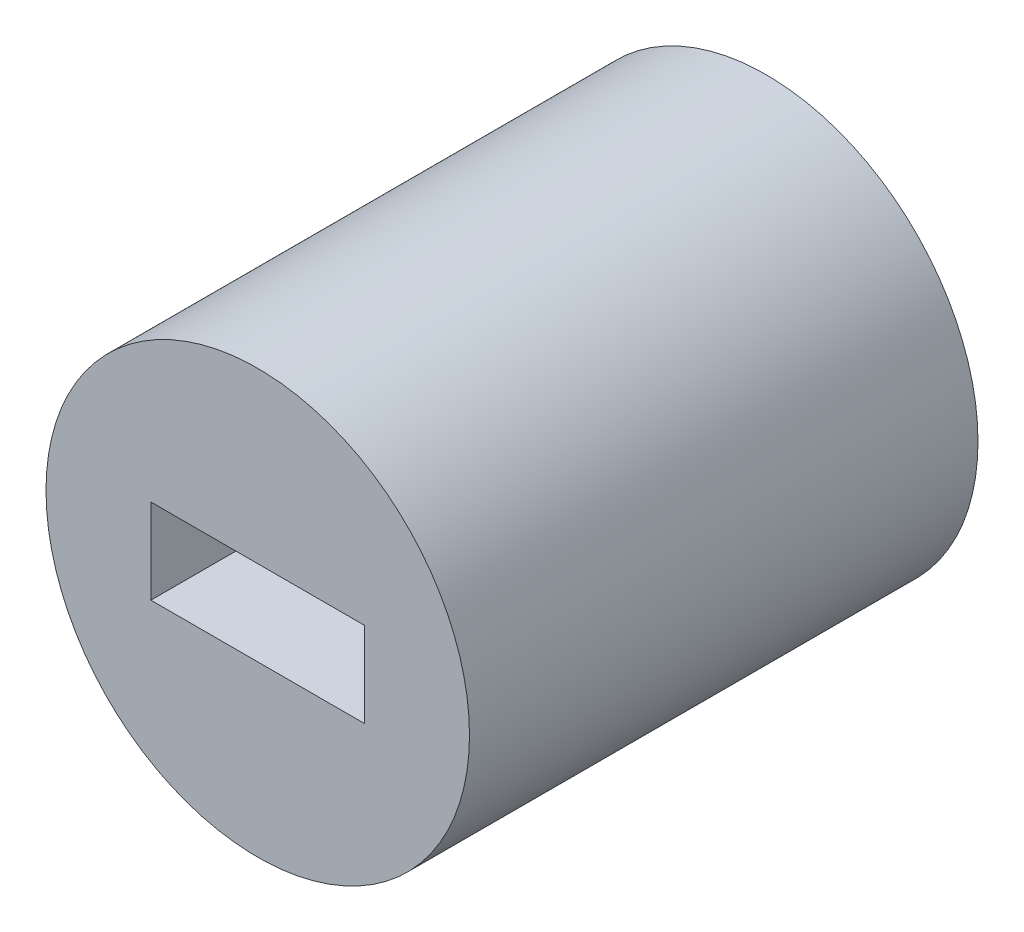
ISO-10303-21;
HEADER;
FILE_DESCRIPTION(('STEP AP214'),'2;1');
FILE_NAME('part.step','',(''),(''),'','','');
FILE_SCHEMA(('AUTOMOTIVE_DESIGN { 1 0 10303 214 1 1 1 1 }'));
ENDSEC;
DATA;
#1=APPLICATION_CONTEXT('core data for automotive mechanical design processes');
#2=APPLICATION_PROTOCOL_DEFINITION('international standard','automotive_design',2000,#1);
#3=PRODUCT_CONTEXT('',#1,'mechanical');
#4=PRODUCT('Part','Part','',(#3));
#5=PRODUCT_RELATED_PRODUCT_CATEGORY('part','',(#4));
#6=PRODUCT_DEFINITION_FORMATION('','',#4);
#7=PRODUCT_DEFINITION_CONTEXT('part definition',#1,'design');
#8=PRODUCT_DEFINITION('design','',#6,#7);
#9=PRODUCT_DEFINITION_SHAPE('','',#8);
#10=(LENGTH_UNIT() NAMED_UNIT(*) SI_UNIT(.MILLI.,.METRE.));
#11=(NAMED_UNIT(*) PLANE_ANGLE_UNIT() SI_UNIT($,.RADIAN.));
#12=(NAMED_UNIT(*) SI_UNIT($,.STERADIAN.) SOLID_ANGLE_UNIT());
#13=UNCERTAINTY_MEASURE_WITH_UNIT(LENGTH_MEASURE(1.E-05),#10,'distance_accuracy_value','');
#14=(GEOMETRIC_REPRESENTATION_CONTEXT(3) GLOBAL_UNCERTAINTY_ASSIGNED_CONTEXT((#13)) GLOBAL_UNIT_ASSIGNED_CONTEXT((#10,
#11,#12)) REPRESENTATION_CONTEXT('',''));
#15=CARTESIAN_POINT('',(0.,0.,0.));
#16=DIRECTION('',(0.,0.,1.));
#17=DIRECTION('',(1.,0.,0.));
#18=AXIS2_PLACEMENT_3D('',#15,#16,#17);
#19=CARTESIAN_POINT('',(-0.64100581951225,0.,3.05));
#20=DIRECTION('',(1.,0.,0.));
#21=DIRECTION('',(0.,1.,0.));
#22=AXIS2_PLACEMENT_3D('',#19,#20,#21);
#23=PLANE('',#22);
#24=DIRECTION('',(0.,1.,0.));
#25=VECTOR('',#24,1.);
#26=CARTESIAN_POINT('',(-0.64100581951225,0.,1.55));
#27=LINE('',#26,#25);
#28=CARTESIAN_POINT('',(-0.64100581951225,0.255,1.55));
#29=VERTEX_POINT('',#28);
#30=CARTESIAN_POINT('',(-0.64100581951225,-0.255,1.55));
#31=VERTEX_POINT('',#30);
#32=EDGE_CURVE('E114',#29,#31,#27,.F.);
#33=ORIENTED_EDGE('',*,*,#32,.F.);
#34=DIRECTION('',(0.,0.,1.));
#35=VECTOR('',#34,1.);
#36=CARTESIAN_POINT('',(-0.64100581951225,0.255,3.05));
#37=LINE('',#36,#35);
#38=CARTESIAN_POINT('',(-0.64100581951225,0.255,3.05));
#39=VERTEX_POINT('',#38);
#40=EDGE_CURVE('E122',#39,#29,#37,.F.);
#41=ORIENTED_EDGE('',*,*,#40,.F.);
#42=DIRECTION('',(0.,1.,0.));
#43=VECTOR('',#42,1.);
#44=CARTESIAN_POINT('',(-0.64100581951225,0.,3.05));
#45=LINE('',#44,#43);
#46=CARTESIAN_POINT('',(-0.64100581951225,-0.255,3.05));
#47=VERTEX_POINT('',#46);
#48=EDGE_CURVE('E32',#39,#47,#45,.F.);
#49=ORIENTED_EDGE('',*,*,#48,.T.);
#50=DIRECTION('',(0.,0.,1.));
#51=VECTOR('',#50,1.);
#52=CARTESIAN_POINT('',(-0.64100581951225,-0.255,3.05));
#53=LINE('',#52,#51);
#54=EDGE_CURVE('E119',#31,#47,#53,.T.);
#55=ORIENTED_EDGE('',*,*,#54,.F.);
#56=EDGE_LOOP('',(#33,#41,#49,#55));
#57=FACE_BOUND('',#56,.T.);
#58=ADVANCED_FACE('F16',(#57),#23,.T.);
#59=CARTESIAN_POINT('',(0.,0.,1.55));
#60=DIRECTION('',(0.,0.,1.));
#61=DIRECTION('',(1.,0.,0.));
#62=AXIS2_PLACEMENT_3D('',#59,#60,#61);
#63=PLANE('',#62);
#64=DIRECTION('',(-1.,0.,0.));
#65=VECTOR('',#64,1.);
#66=CARTESIAN_POINT('',(0.528723609904574,-0.255,1.55));
#67=LINE('',#66,#65);
#68=CARTESIAN_POINT('',(-0.416441400296898,-0.255,1.55));
#69=VERTEX_POINT('',#68);
#70=EDGE_CURVE('E127',#69,#31,#67,.T.);
#71=ORIENTED_EDGE('',*,*,#70,.F.);
#72=DIRECTION('',(0.,-1.,0.));
#73=VECTOR('',#72,1.);
#74=CARTESIAN_POINT('',(-0.416441400296898,0.,1.55));
#75=LINE('',#74,#73);
#76=CARTESIAN_POINT('',(-0.416441400296898,0.255,1.55));
#77=VERTEX_POINT('',#76);
#78=EDGE_CURVE('E112',#69,#77,#75,.F.);
#79=ORIENTED_EDGE('',*,*,#78,.T.);
#80=DIRECTION('',(1.,0.,0.));
#81=VECTOR('',#80,1.);
#82=CARTESIAN_POINT('',(-0.528723609904574,0.255,1.55));
#83=LINE('',#82,#81);
#84=EDGE_CURVE('E148',#29,#77,#83,.T.);
#85=ORIENTED_EDGE('',*,*,#84,.F.);
#86=ORIENTED_EDGE('',*,*,#32,.T.);
#87=EDGE_LOOP('',(#71,#79,#85,#86));
#88=FACE_BOUND('',#87,.T.);
#89=ADVANCED_FACE('F159',(#88),#63,.T.);
#90=CARTESIAN_POINT('',(-0.416441400296898,0.,3.05));
#91=DIRECTION('',(-1.,0.,0.));
#92=DIRECTION('',(0.,-1.,0.));
#93=AXIS2_PLACEMENT_3D('',#90,#91,#92);
#94=PLANE('',#93);
#95=DIRECTION('',(0.,0.,1.));
#96=VECTOR('',#95,1.);
#97=CARTESIAN_POINT('',(-0.416441400296898,0.255,3.05));
#98=LINE('',#97,#96);
#99=CARTESIAN_POINT('',(-0.416441400296898,0.255,0.));
#100=VERTEX_POINT('',#99);
#101=EDGE_CURVE('E145',#77,#100,#98,.F.);
#102=ORIENTED_EDGE('',*,*,#101,.F.);
#103=ORIENTED_EDGE('',*,*,#78,.F.);
#104=DIRECTION('',(0.,0.,1.));
#105=VECTOR('',#104,1.);
#106=CARTESIAN_POINT('',(-0.416441400296898,-0.255,3.05));
#107=LINE('',#106,#105);
#108=CARTESIAN_POINT('',(-0.416441400296898,-0.255,0.));
#109=VERTEX_POINT('',#108);
#110=EDGE_CURVE('E96',#109,#69,#107,.T.);
#111=ORIENTED_EDGE('',*,*,#110,.F.);
#112=DIRECTION('',(0.,-1.,0.));
#113=VECTOR('',#112,1.);
#114=CARTESIAN_POINT('',(-0.416441400296898,0.,0.));
#115=LINE('',#114,#113);
#116=EDGE_CURVE('E110',#100,#109,#115,.T.);
#117=ORIENTED_EDGE('',*,*,#116,.F.);
#118=EDGE_LOOP('',(#102,#103,#111,#117));
#119=FACE_BOUND('',#118,.T.);
#120=ADVANCED_FACE('F156',(#119),#94,.F.);
#121=CARTESIAN_POINT('',(0.416441400296898,0.,3.05));
#122=DIRECTION('',(1.,0.,0.));
#123=DIRECTION('',(0.,1.,0.));
#124=AXIS2_PLACEMENT_3D('',#121,#122,#123);
#125=PLANE('',#124);
#126=DIRECTION('',(0.,0.,1.));
#127=VECTOR('',#126,1.);
#128=CARTESIAN_POINT('',(0.416441400296898,-0.255,3.05));
#129=LINE('',#128,#127);
#130=CARTESIAN_POINT('',(0.416441400296898,-0.255,1.55));
#131=VERTEX_POINT('',#130);
#132=CARTESIAN_POINT('',(0.416441400296898,-0.255,0.));
#133=VERTEX_POINT('',#132);
#134=EDGE_CURVE('E91',#131,#133,#129,.F.);
#135=ORIENTED_EDGE('',*,*,#134,.F.);
#136=DIRECTION('',(0.,1.,0.));
#137=VECTOR('',#136,1.);
#138=CARTESIAN_POINT('',(0.416441400296898,0.,1.55));
#139=LINE('',#138,#137);
#140=CARTESIAN_POINT('',(0.416441400296898,0.255,1.55));
#141=VERTEX_POINT('',#140);
#142=EDGE_CURVE('E79',#141,#131,#139,.F.);
#143=ORIENTED_EDGE('',*,*,#142,.F.);
#144=DIRECTION('',(0.,0.,1.));
#145=VECTOR('',#144,1.);
#146=CARTESIAN_POINT('',(0.416441400296898,0.255,3.05));
#147=LINE('',#146,#145);
#148=CARTESIAN_POINT('',(0.416441400296898,0.255,0.));
#149=VERTEX_POINT('',#148);
#150=EDGE_CURVE('E143',#149,#141,#147,.T.);
#151=ORIENTED_EDGE('',*,*,#150,.F.);
#152=DIRECTION('',(0.,1.,0.));
#153=VECTOR('',#152,1.);
#154=CARTESIAN_POINT('',(0.416441400296898,0.,0.));
#155=LINE('',#154,#153);
#156=EDGE_CURVE('E88',#133,#149,#155,.T.);
#157=ORIENTED_EDGE('',*,*,#156,.F.);
#158=EDGE_LOOP('',(#135,#143,#151,#157));
#159=FACE_BOUND('',#158,.T.);
#160=ADVANCED_FACE('F92',(#159),#125,.F.);
#161=CARTESIAN_POINT('',(0.,0.,1.55));
#162=DIRECTION('',(0.,0.,1.));
#163=DIRECTION('',(1.,0.,0.));
#164=AXIS2_PLACEMENT_3D('',#161,#162,#163);
#165=PLANE('',#164);
#166=ORIENTED_EDGE('',*,*,#142,.T.);
#167=DIRECTION('',(-1.,0.,0.));
#168=VECTOR('',#167,1.);
#169=CARTESIAN_POINT('',(0.528723609904574,-0.255,1.55));
#170=LINE('',#169,#168);
#171=CARTESIAN_POINT('',(0.64100581951225,-0.255,1.55));
#172=VERTEX_POINT('',#171);
#173=EDGE_CURVE('E76',#172,#131,#170,.T.);
#174=ORIENTED_EDGE('',*,*,#173,.F.);
#175=DIRECTION('',(0.,-1.,0.));
#176=VECTOR('',#175,1.);
#177=CARTESIAN_POINT('',(0.64100581951225,0.,1.55));
#178=LINE('',#177,#176);
#179=CARTESIAN_POINT('',(0.64100581951225,0.255,1.55));
#180=VERTEX_POINT('',#179);
#181=EDGE_CURVE('E87',#180,#172,#178,.T.);
#182=ORIENTED_EDGE('',*,*,#181,.F.);
#183=DIRECTION('',(1.,0.,0.));
#184=VECTOR('',#183,1.);
#185=CARTESIAN_POINT('',(-0.528723609904574,0.255,1.55));
#186=LINE('',#185,#184);
#187=EDGE_CURVE('E83',#141,#180,#186,.T.);
#188=ORIENTED_EDGE('',*,*,#187,.F.);
#189=EDGE_LOOP('',(#166,#174,#182,#188));
#190=FACE_BOUND('',#189,.T.);
#191=ADVANCED_FACE('F81',(#190),#165,.T.);
#192=CARTESIAN_POINT('',(0.64100581951225,0.,3.05));
#193=DIRECTION('',(-1.,0.,0.));
#194=DIRECTION('',(0.,-1.,0.));
#195=AXIS2_PLACEMENT_3D('',#192,#193,#194);
#196=PLANE('',#195);
#197=DIRECTION('',(0.,-1.,0.));
#198=VECTOR('',#197,1.);
#199=CARTESIAN_POINT('',(0.64100581951225,0.,3.05));
#200=LINE('',#199,#198);
#201=CARTESIAN_POINT('',(0.64100581951225,-0.255,3.05));
#202=VERTEX_POINT('',#201);
#203=CARTESIAN_POINT('',(0.64100581951225,0.255,3.05));
#204=VERTEX_POINT('',#203);
#205=EDGE_CURVE('E103',#202,#204,#200,.F.);
#206=ORIENTED_EDGE('',*,*,#205,.T.);
#207=DIRECTION('',(0.,0.,1.));
#208=VECTOR('',#207,1.);
#209=CARTESIAN_POINT('',(0.64100581951225,0.255,3.05));
#210=LINE('',#209,#208);
#211=EDGE_CURVE('E139',#180,#204,#210,.T.);
#212=ORIENTED_EDGE('',*,*,#211,.F.);
#213=ORIENTED_EDGE('',*,*,#181,.T.);
#214=DIRECTION('',(0.,0.,1.));
#215=VECTOR('',#214,1.);
#216=CARTESIAN_POINT('',(0.64100581951225,-0.255,3.05));
#217=LINE('',#216,#215);
#218=EDGE_CURVE('E102',#202,#172,#217,.F.);
#219=ORIENTED_EDGE('',*,*,#218,.F.);
#220=EDGE_LOOP('',(#206,#212,#213,#219));
#221=FACE_BOUND('',#220,.T.);
#222=ADVANCED_FACE('F164',(#221),#196,.T.);
#223=CARTESIAN_POINT('',(0.528723609904574,-0.255,3.05));
#224=DIRECTION('',(0.,1.,0.));
#225=DIRECTION('',(-1.,0.,0.));
#226=AXIS2_PLACEMENT_3D('',#223,#224,#225);
#227=PLANE('',#226);
#228=DIRECTION('',(1.,0.,0.));
#229=VECTOR('',#228,1.);
#230=CARTESIAN_POINT('',(0.,-0.255,3.05));
#231=LINE('',#230,#229);
#232=EDGE_CURVE('E124',#202,#47,#231,.F.);
#233=ORIENTED_EDGE('',*,*,#232,.F.);
#234=ORIENTED_EDGE('',*,*,#218,.T.);
#235=ORIENTED_EDGE('',*,*,#173,.T.);
#236=ORIENTED_EDGE('',*,*,#134,.T.);
#237=DIRECTION('',(1.,0.,0.));
#238=VECTOR('',#237,1.);
#239=CARTESIAN_POINT('',(0.,-0.255,0.));
#240=LINE('',#239,#238);
#241=EDGE_CURVE('E135',#133,#109,#240,.F.);
#242=ORIENTED_EDGE('',*,*,#241,.T.);
#243=ORIENTED_EDGE('',*,*,#110,.T.);
#244=ORIENTED_EDGE('',*,*,#70,.T.);
#245=ORIENTED_EDGE('',*,*,#54,.T.);
#246=EDGE_LOOP('',(#233,#234,#235,#236,#242,#243,#244,#245));
#247=FACE_BOUND('',#246,.T.);
#248=ADVANCED_FACE('F100',(#247),#227,.T.);
#249=CARTESIAN_POINT('',(-0.528723609904574,0.255,3.05));
#250=DIRECTION('',(0.,-1.,0.));
#251=DIRECTION('',(1.,0.,0.));
#252=AXIS2_PLACEMENT_3D('',#249,#250,#251);
#253=PLANE('',#252);
#254=ORIENTED_EDGE('',*,*,#187,.T.);
#255=ORIENTED_EDGE('',*,*,#211,.T.);
#256=DIRECTION('',(1.,0.,0.));
#257=VECTOR('',#256,1.);
#258=CARTESIAN_POINT('',(0.,0.255,3.05));
#259=LINE('',#258,#257);
#260=EDGE_CURVE('E130',#39,#204,#259,.T.);
#261=ORIENTED_EDGE('',*,*,#260,.F.);
#262=ORIENTED_EDGE('',*,*,#40,.T.);
#263=ORIENTED_EDGE('',*,*,#84,.T.);
#264=ORIENTED_EDGE('',*,*,#101,.T.);
#265=DIRECTION('',(1.,0.,0.));
#266=VECTOR('',#265,1.);
#267=CARTESIAN_POINT('',(0.,0.255,0.));
#268=LINE('',#267,#266);
#269=EDGE_CURVE('E131',#100,#149,#268,.T.);
#270=ORIENTED_EDGE('',*,*,#269,.T.);
#271=ORIENTED_EDGE('',*,*,#150,.T.);
#272=EDGE_LOOP('',(#254,#255,#261,#262,#263,#264,#270,#271));
#273=FACE_BOUND('',#272,.T.);
#274=ADVANCED_FACE('F161',(#273),#253,.T.);
#275=CARTESIAN_POINT('',(0.,0.,0.));
#276=DIRECTION('',(0.,0.,1.));
#277=DIRECTION('',(1.,0.,0.));
#278=AXIS2_PLACEMENT_3D('',#275,#276,#277);
#279=PLANE('',#278);
#280=CARTESIAN_POINT('',(0.,0.,0.));
#281=DIRECTION('',(0.,0.,1.));
#282=DIRECTION('',(1.,0.,0.));
#283=AXIS2_PLACEMENT_3D('',#280,#281,#282);
#284=CIRCLE('',#283,1.27);
#285=CARTESIAN_POINT('',(1.27,0.,0.));
#286=VERTEX_POINT('',#285);
#287=EDGE_CURVE('E19',#286,#286,#284,.T.);
#288=ORIENTED_EDGE('',*,*,#287,.F.);
#289=EDGE_LOOP('',(#288));
#290=FACE_BOUND('',#289,.T.);
#291=ORIENTED_EDGE('',*,*,#116,.T.);
#292=ORIENTED_EDGE('',*,*,#241,.F.);
#293=ORIENTED_EDGE('',*,*,#156,.T.);
#294=ORIENTED_EDGE('',*,*,#269,.F.);
#295=EDGE_LOOP('',(#291,#292,#293,#294));
#296=FACE_BOUND('',#295,.T.);
#297=ADVANCED_FACE('F181',(#290,#296),#279,.F.);
#298=CARTESIAN_POINT('',(0.,0.,3.05));
#299=DIRECTION('',(0.,0.,1.));
#300=DIRECTION('',(1.,0.,0.));
#301=AXIS2_PLACEMENT_3D('',#298,#299,#300);
#302=PLANE('',#301);
#303=CARTESIAN_POINT('',(0.,0.,3.05));
#304=DIRECTION('',(0.,0.,1.));
#305=DIRECTION('',(1.,0.,0.));
#306=AXIS2_PLACEMENT_3D('',#303,#304,#305);
#307=CIRCLE('',#306,1.27);
#308=CARTESIAN_POINT('',(1.27,0.,3.05));
#309=VERTEX_POINT('',#308);
#310=EDGE_CURVE('E11',#309,#309,#307,.F.);
#311=ORIENTED_EDGE('',*,*,#310,.F.);
#312=EDGE_LOOP('',(#311));
#313=FACE_BOUND('',#312,.T.);
#314=ORIENTED_EDGE('',*,*,#48,.F.);
#315=ORIENTED_EDGE('',*,*,#260,.T.);
#316=ORIENTED_EDGE('',*,*,#205,.F.);
#317=ORIENTED_EDGE('',*,*,#232,.T.);
#318=EDGE_LOOP('',(#314,#315,#316,#317));
#319=FACE_BOUND('',#318,.T.);
#320=ADVANCED_FACE('F129',(#313,#319),#302,.T.);
#321=CARTESIAN_POINT('',(0.,0.,0.));
#322=DIRECTION('',(0.,0.,1.));
#323=DIRECTION('',(1.,0.,0.));
#324=AXIS2_PLACEMENT_3D('',#321,#322,#323);
#325=CYLINDRICAL_SURFACE('',#324,1.27);
#326=ORIENTED_EDGE('',*,*,#287,.T.);
#327=EDGE_LOOP('',(#326));
#328=FACE_BOUND('',#327,.T.);
#329=ORIENTED_EDGE('',*,*,#310,.T.);
#330=EDGE_LOOP('',(#329));
#331=FACE_BOUND('',#330,.T.);
#332=ADVANCED_FACE('F174',(#328,#331),#325,.T.);
#333=CLOSED_SHELL('',(#58,#89,#120,#160,#191,#222,#248,#274,#297,#320,#332));
#334=MANIFOLD_SOLID_BREP('B1',#333);
#335=ADVANCED_BREP_SHAPE_REPRESENTATION('',(#18,#334),#14);
#336=SHAPE_DEFINITION_REPRESENTATION(#9,#335);
ENDSEC;
END-ISO-10303-21;
